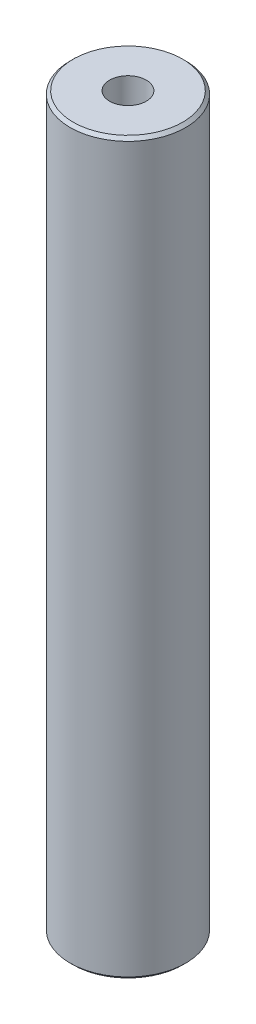
ISO-10303-21;
HEADER;
FILE_DESCRIPTION(('STEP AP214'),'2;1');
FILE_NAME('part.step','',(''),(''),'','','');
FILE_SCHEMA(('AUTOMOTIVE_DESIGN { 1 0 10303 214 1 1 1 1 }'));
ENDSEC;
DATA;
#1=APPLICATION_CONTEXT('core data for automotive mechanical design processes');
#2=APPLICATION_PROTOCOL_DEFINITION('international standard','automotive_design',2000,#1);
#3=PRODUCT_CONTEXT('',#1,'mechanical');
#4=PRODUCT('Part','Part','',(#3));
#5=PRODUCT_RELATED_PRODUCT_CATEGORY('part','',(#4));
#6=PRODUCT_DEFINITION_FORMATION('','',#4);
#7=PRODUCT_DEFINITION_CONTEXT('part definition',#1,'design');
#8=PRODUCT_DEFINITION('design','',#6,#7);
#9=PRODUCT_DEFINITION_SHAPE('','',#8);
#10=(LENGTH_UNIT() NAMED_UNIT(*) SI_UNIT(.MILLI.,.METRE.));
#11=(NAMED_UNIT(*) PLANE_ANGLE_UNIT() SI_UNIT($,.RADIAN.));
#12=(NAMED_UNIT(*) SI_UNIT($,.STERADIAN.) SOLID_ANGLE_UNIT());
#13=UNCERTAINTY_MEASURE_WITH_UNIT(LENGTH_MEASURE(1.E-05),#10,'distance_accuracy_value','');
#14=(GEOMETRIC_REPRESENTATION_CONTEXT(3) GLOBAL_UNCERTAINTY_ASSIGNED_CONTEXT((#13)) GLOBAL_UNIT_ASSIGNED_CONTEXT((#10,
#11,#12)) REPRESENTATION_CONTEXT('',''));
#15=CARTESIAN_POINT('',(0.,0.,0.));
#16=DIRECTION('',(0.,0.,1.));
#17=DIRECTION('',(1.,0.,0.));
#18=AXIS2_PLACEMENT_3D('',#15,#16,#17);
#19=CARTESIAN_POINT('',(0.,600.,0.));
#20=DIRECTION('',(0.,-1.,0.));
#21=DIRECTION('',(0.,0.,-1.));
#22=AXIS2_PLACEMENT_3D('',#19,#20,#21);
#23=CYLINDRICAL_SURFACE('',#22,47.5);
#24=CARTESIAN_POINT('',(0.,597.470238234432,0.));
#25=DIRECTION('',(0.,1.,0.));
#26=DIRECTION('',(0.,0.,1.));
#27=AXIS2_PLACEMENT_3D('',#24,#25,#26);
#28=CIRCLE('',#27,47.5);
#29=CARTESIAN_POINT('',(0.,597.470238234432,47.5));
#30=VERTEX_POINT('',#29);
#31=EDGE_CURVE('E50',#30,#30,#28,.F.);
#32=ORIENTED_EDGE('',*,*,#31,.T.);
#33=EDGE_LOOP('',(#32));
#34=FACE_BOUND('',#33,.T.);
#35=CARTESIAN_POINT('',(0.,2.52976176556796,0.));
#36=DIRECTION('',(0.,1.,0.));
#37=DIRECTION('',(0.,0.,1.));
#38=AXIS2_PLACEMENT_3D('',#35,#36,#37);
#39=CIRCLE('',#38,47.5);
#40=CARTESIAN_POINT('',(0.,2.52976176556796,47.5));
#41=VERTEX_POINT('',#40);
#42=EDGE_CURVE('E51',#41,#41,#39,.T.);
#43=ORIENTED_EDGE('',*,*,#42,.T.);
#44=EDGE_LOOP('',(#43));
#45=FACE_BOUND('',#44,.T.);
#46=ADVANCED_FACE('F39',(#34,#45),#23,.T.);
#47=CARTESIAN_POINT('',(0.,600.,0.));
#48=DIRECTION('',(0.,1.,0.));
#49=DIRECTION('',(0.,0.,1.));
#50=AXIS2_PLACEMENT_3D('',#47,#48,#49);
#51=PLANE('',#50);
#52=CARTESIAN_POINT('',(0.,600.,0.));
#53=DIRECTION('',(0.,1.,0.));
#54=DIRECTION('',(0.,0.,1.));
#55=AXIS2_PLACEMENT_3D('',#52,#53,#54);
#56=CIRCLE('',#55,44.970238234432);
#57=CARTESIAN_POINT('',(0.,600.,44.970238234432));
#58=VERTEX_POINT('',#57);
#59=EDGE_CURVE('E54',#58,#58,#56,.T.);
#60=ORIENTED_EDGE('',*,*,#59,.T.);
#61=EDGE_LOOP('',(#60));
#62=FACE_BOUND('',#61,.T.);
#63=CARTESIAN_POINT('',(0.,600.,0.));
#64=DIRECTION('',(0.,1.,0.));
#65=DIRECTION('',(0.,0.,1.));
#66=AXIS2_PLACEMENT_3D('',#63,#64,#65);
#67=CIRCLE('',#66,15.0751458134594);
#68=CARTESIAN_POINT('',(0.,600.,15.0751458134594));
#69=VERTEX_POINT('',#68);
#70=EDGE_CURVE('E58',#69,#69,#67,.T.);
#71=ORIENTED_EDGE('',*,*,#70,.F.);
#72=EDGE_LOOP('',(#71));
#73=FACE_BOUND('',#72,.T.);
#74=ADVANCED_FACE('F69',(#62,#73),#51,.T.);
#75=CARTESIAN_POINT('',(0.,0.,0.));
#76=DIRECTION('',(0.,1.,0.));
#77=DIRECTION('',(0.,0.,1.));
#78=AXIS2_PLACEMENT_3D('',#75,#76,#77);
#79=PLANE('',#78);
#80=CARTESIAN_POINT('',(0.,0.,0.));
#81=DIRECTION('',(0.,1.,0.));
#82=DIRECTION('',(0.,0.,1.));
#83=AXIS2_PLACEMENT_3D('',#80,#81,#82);
#84=CIRCLE('',#83,44.970238234432);
#85=CARTESIAN_POINT('',(0.,0.,44.970238234432));
#86=VERTEX_POINT('',#85);
#87=EDGE_CURVE('E10',#86,#86,#84,.F.);
#88=ORIENTED_EDGE('',*,*,#87,.T.);
#89=EDGE_LOOP('',(#88));
#90=FACE_BOUND('',#89,.T.);
#91=CARTESIAN_POINT('',(0.,0.,0.));
#92=DIRECTION('',(0.,1.,0.));
#93=DIRECTION('',(0.,0.,1.));
#94=AXIS2_PLACEMENT_3D('',#91,#92,#93);
#95=CIRCLE('',#94,15.0751458134594);
#96=CARTESIAN_POINT('',(0.,0.,15.0751458134594));
#97=VERTEX_POINT('',#96);
#98=EDGE_CURVE('E63',#97,#97,#95,.T.);
#99=ORIENTED_EDGE('',*,*,#98,.T.);
#100=EDGE_LOOP('',(#99));
#101=FACE_BOUND('',#100,.T.);
#102=ADVANCED_FACE('F75',(#90,#101),#79,.F.);
#103=CARTESIAN_POINT('',(0.,600.,0.));
#104=DIRECTION('',(0.,-1.,0.));
#105=DIRECTION('',(0.,0.,-1.));
#106=AXIS2_PLACEMENT_3D('',#103,#104,#105);
#107=CYLINDRICAL_SURFACE('',#106,15.0751458134594);
#108=ORIENTED_EDGE('',*,*,#70,.T.);
#109=EDGE_LOOP('',(#108));
#110=FACE_BOUND('',#109,.T.);
#111=ORIENTED_EDGE('',*,*,#98,.F.);
#112=EDGE_LOOP('',(#111));
#113=FACE_BOUND('',#112,.T.);
#114=ADVANCED_FACE('F70',(#110,#113),#107,.F.);
#115=CARTESIAN_POINT('',(0.,600.,0.));
#116=DIRECTION('',(0.,-1.,0.));
#117=DIRECTION('',(0.,0.,-1.));
#118=AXIS2_PLACEMENT_3D('',#115,#116,#117);
#119=CONICAL_SURFACE('',#118,44.970238234432,0.785398163397443);
#120=ORIENTED_EDGE('',*,*,#31,.F.);
#121=EDGE_LOOP('',(#120));
#122=FACE_BOUND('',#121,.T.);
#123=ORIENTED_EDGE('',*,*,#59,.F.);
#124=EDGE_LOOP('',(#123));
#125=FACE_BOUND('',#124,.T.);
#126=ADVANCED_FACE('F81',(#122,#125),#119,.T.);
#127=CARTESIAN_POINT('',(0.,2.52976176556796,0.));
#128=DIRECTION('',(0.,1.,0.));
#129=DIRECTION('',(0.,0.,1.));
#130=AXIS2_PLACEMENT_3D('',#127,#128,#129);
#131=CONICAL_SURFACE('',#130,47.5,0.785398163397463);
#132=CARTESIAN_POINT('',(0.,0.,44.970238234432));
#133=CARTESIAN_POINT('',(0.,0.0263516850580008,44.99658991949));
#134=CARTESIAN_POINT('',(0.,0.0527033701159999,45.022941604548));
#135=CARTESIAN_POINT('',(0.,0.105406740231998,45.075644974664));
#136=CARTESIAN_POINT('',(0.,0.131758425289997,45.101996659722));
#137=CARTESIAN_POINT('',(0.,0.184461795405996,45.154700029838));
#138=CARTESIAN_POINT('',(0.,0.210813480463996,45.181051714896));
#139=CARTESIAN_POINT('',(0.,0.263516850579996,45.233755085012));
#140=CARTESIAN_POINT('',(0.,0.289868535637996,45.26010677007));
#141=CARTESIAN_POINT('',(0.,0.342571905753995,45.312810140186));
#142=CARTESIAN_POINT('',(0.,0.368923590811994,45.339161825244));
#143=CARTESIAN_POINT('',(0.,0.421626960927992,45.39186519536));
#144=CARTESIAN_POINT('',(0.,0.447978645985992,45.418216880418));
#145=CARTESIAN_POINT('',(0.,0.500682016101992,45.470920250534));
#146=CARTESIAN_POINT('',(0.,0.527033701159992,45.497271935592));
#147=CARTESIAN_POINT('',(0.,0.579737071275991,45.549975305708));
#148=CARTESIAN_POINT('',(0.,0.60608875633399,45.576326990766));
#149=CARTESIAN_POINT('',(0.,0.658792126449989,45.629030360882));
#150=CARTESIAN_POINT('',(0.,0.685143811507989,45.65538204594));
#151=CARTESIAN_POINT('',(0.,0.737847181623989,45.708085416056));
#152=CARTESIAN_POINT('',(0.,0.764198866681989,45.734437101114));
#153=CARTESIAN_POINT('',(0.,0.816902236797988,45.78714047123));
#154=CARTESIAN_POINT('',(0.,0.843253921855987,45.813492156288));
#155=CARTESIAN_POINT('',(0.,0.895957291971985,45.866195526404));
#156=CARTESIAN_POINT('',(0.,0.922308977029985,45.892547211462));
#157=CARTESIAN_POINT('',(0.,0.975012347145985,45.945250581578));
#158=CARTESIAN_POINT('',(0.,1.00136403220399,45.971602266636));
#159=CARTESIAN_POINT('',(0.,1.05406740231998,46.024305636752));
#160=CARTESIAN_POINT('',(0.,1.08041908737798,46.05065732181));
#161=CARTESIAN_POINT('',(0.,1.13312245749398,46.103360691926));
#162=CARTESIAN_POINT('',(0.,1.15947414255198,46.129712376984));
#163=CARTESIAN_POINT('',(0.,1.21217751266798,46.1824157471));
#164=CARTESIAN_POINT('',(0.,1.23852919772598,46.208767432158));
#165=CARTESIAN_POINT('',(0.,1.29123256784198,46.261470802274));
#166=CARTESIAN_POINT('',(0.,1.31758425289998,46.287822487332));
#167=CARTESIAN_POINT('',(0.,1.37028762301598,46.340525857448));
#168=CARTESIAN_POINT('',(0.,1.39663930807398,46.366877542506));
#169=CARTESIAN_POINT('',(0.,1.44934267818998,46.419580912622));
#170=CARTESIAN_POINT('',(0.,1.47569436324798,46.44593259768));
#171=CARTESIAN_POINT('',(0.,1.52839773336398,46.498635967796));
#172=CARTESIAN_POINT('',(0.,1.55474941842198,46.524987652854));
#173=CARTESIAN_POINT('',(0.,1.60745278853797,46.57769102297));
#174=CARTESIAN_POINT('',(0.,1.63380447359598,46.604042708028));
#175=CARTESIAN_POINT('',(0.,1.68650784371198,46.656746078144));
#176=CARTESIAN_POINT('',(0.,1.71285952876997,46.683097763202));
#177=CARTESIAN_POINT('',(0.,1.76556289888597,46.735801133318));
#178=CARTESIAN_POINT('',(0.,1.79191458394397,46.762152818376));
#179=CARTESIAN_POINT('',(0.,1.84461795405997,46.814856188492));
#180=CARTESIAN_POINT('',(0.,1.87096963911797,46.84120787355));
#181=CARTESIAN_POINT('',(0.,1.92367300923397,46.893911243666));
#182=CARTESIAN_POINT('',(0.,1.95002469429197,46.920262928724));
#183=CARTESIAN_POINT('',(0.,2.00272806440797,46.97296629884));
#184=CARTESIAN_POINT('',(0.,2.02907974946597,46.999317983898));
#185=CARTESIAN_POINT('',(0.,2.08178311958197,47.052021354014));
#186=CARTESIAN_POINT('',(0.,2.10813480463997,47.078373039072));
#187=CARTESIAN_POINT('',(0.,2.16083817475597,47.131076409188));
#188=CARTESIAN_POINT('',(0.,2.18718985981397,47.157428094246));
#189=CARTESIAN_POINT('',(0.,2.23989322992997,47.210131464362));
#190=CARTESIAN_POINT('',(0.,2.26624491498797,47.23648314942));
#191=CARTESIAN_POINT('',(0.,2.31894828510397,47.289186519536));
#192=CARTESIAN_POINT('',(0.,2.34529997016196,47.315538204594));
#193=CARTESIAN_POINT('',(0.,2.39800334027796,47.36824157471));
#194=CARTESIAN_POINT('',(0.,2.42435502533596,47.394593259768));
#195=CARTESIAN_POINT('',(0.,2.47705839545196,47.447296629884));
#196=CARTESIAN_POINT('',(0.,2.50341008050996,47.473648314942));
#197=CARTESIAN_POINT('',(0.,2.52976176556796,47.5));
#198=B_SPLINE_CURVE_WITH_KNOTS('',3,(#132,#133,#134,#135,#136,#137,#138,#139,#140,#141,#142,
#143,#144,#145,#146,#147,#148,#149,#150,#151,#152,#153,#154,#155,#156,#157,#158,#159,#160,#161,
#162,#163,#164,#165,#166,#167,#168,#169,#170,#171,#172,#173,#174,#175,#176,#177,#178,#179,#180,
#181,#182,#183,#184,#185,#186,#187,#188,#189,#190,#191,#192,#193,#194,#195,#196,#197),
.UNSPECIFIED.,.F.,.F.,(4,2,2,2,2,2,2,2,2,2,2,2,2,2,2,2,2,2,2,2,2,2,2,2,2,2,2,2,2,2,2,2,4),(0.,
0.111800731201222,0.22360146240245,0.335402193603672,0.447202924804895,0.559003656006122,
0.670804387207344,0.782605118408567,0.894405849609794,1.00620658081102,1.11800731201224,
1.22980804321347,1.34160877441469,1.45340950561591,1.56521023681714,1.67701096801836,
1.78881169921958,1.90061243042081,2.01241316162203,2.12421389282326,2.23601462402448,
2.34781535522571,2.45961608642693,2.57141681762816,2.68321754882938,2.7950182800306,
2.90681901123183,3.01861974243305,3.13042047363428,3.2422212048355,3.35402193603672,
3.46582266723795,3.57762339843917),.UNSPECIFIED.);
#199=EDGE_CURVE('BSEAM45',#86,#41,#198,.T.);
#200=ORIENTED_EDGE('',*,*,#87,.F.);
#201=ORIENTED_EDGE('',*,*,#42,.F.);
#202=ORIENTED_EDGE('',*,*,#199,.T.);
#203=ORIENTED_EDGE('',*,*,#199,.F.);
#204=EDGE_LOOP('',(#200,#202,#201,#203));
#205=FACE_BOUND('',#204,.T.);
#206=ADVANCED_FACE('F45',(#205),#131,.T.);
#207=CLOSED_SHELL('',(#46,#74,#102,#114,#126,#206));
#208=MANIFOLD_SOLID_BREP('B2',#207);
#209=ADVANCED_BREP_SHAPE_REPRESENTATION('',(#18,#208),#14);
#210=SHAPE_DEFINITION_REPRESENTATION(#9,#209);
ENDSEC;
END-ISO-10303-21;
